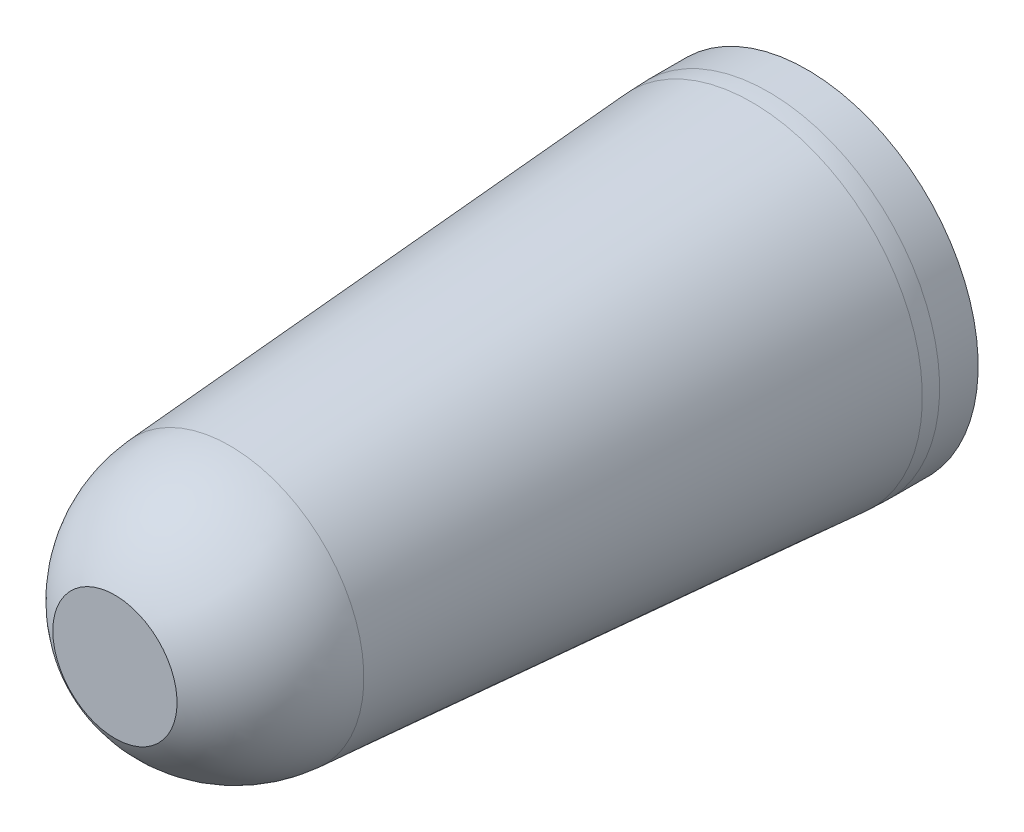
ISO-10303-21;
HEADER;
FILE_DESCRIPTION(('STEP AP214'),'2;1');
FILE_NAME('part.step','',(''),(''),'','','');
FILE_SCHEMA(('AUTOMOTIVE_DESIGN { 1 0 10303 214 1 1 1 1 }'));
ENDSEC;
DATA;
#1=APPLICATION_CONTEXT('core data for automotive mechanical design processes');
#2=APPLICATION_PROTOCOL_DEFINITION('international standard','automotive_design',2000,#1);
#3=PRODUCT_CONTEXT('',#1,'mechanical');
#4=PRODUCT('Part','Part','',(#3));
#5=PRODUCT_RELATED_PRODUCT_CATEGORY('part','',(#4));
#6=PRODUCT_DEFINITION_FORMATION('','',#4);
#7=PRODUCT_DEFINITION_CONTEXT('part definition',#1,'design');
#8=PRODUCT_DEFINITION('design','',#6,#7);
#9=PRODUCT_DEFINITION_SHAPE('','',#8);
#10=(LENGTH_UNIT() NAMED_UNIT(*) SI_UNIT(.MILLI.,.METRE.));
#11=(NAMED_UNIT(*) PLANE_ANGLE_UNIT() SI_UNIT($,.RADIAN.));
#12=(NAMED_UNIT(*) SI_UNIT($,.STERADIAN.) SOLID_ANGLE_UNIT());
#13=UNCERTAINTY_MEASURE_WITH_UNIT(LENGTH_MEASURE(1.E-05),#10,'distance_accuracy_value','');
#14=(GEOMETRIC_REPRESENTATION_CONTEXT(3) GLOBAL_UNCERTAINTY_ASSIGNED_CONTEXT((#13)) GLOBAL_UNIT_ASSIGNED_CONTEXT((#10,
#11,#12)) REPRESENTATION_CONTEXT('',''));
#15=CARTESIAN_POINT('',(0.,0.,0.));
#16=DIRECTION('',(0.,0.,1.));
#17=DIRECTION('',(1.,0.,0.));
#18=AXIS2_PLACEMENT_3D('',#15,#16,#17);
#19=CARTESIAN_POINT('',(0.,49.747863484737,0.));
#20=DIRECTION('',(0.,0.,-1.));
#21=DIRECTION('',(-1.,0.,0.));
#22=AXIS2_PLACEMENT_3D('',#19,#20,#21);
#23=PLANE('',#22);
#24=CARTESIAN_POINT('',(0.,-7.40213651526299,0.));
#25=DIRECTION('',(0.,0.,-1.));
#26=DIRECTION('',(-1.,0.,0.));
#27=AXIS2_PLACEMENT_3D('',#24,#25,#26);
#28=CIRCLE('',#27,57.15);
#29=CARTESIAN_POINT('',(-57.15,-7.40213651526299,0.));
#30=VERTEX_POINT('',#29);
#31=EDGE_CURVE('E10',#30,#30,#28,.T.);
#32=ORIENTED_EDGE('',*,*,#31,.T.);
#33=EDGE_LOOP('',(#32));
#34=FACE_BOUND('',#33,.T.);
#35=ADVANCED_FACE('F31',(#34),#23,.T.);
#36=CARTESIAN_POINT('',(0.,-7.40213651526299,0.));
#37=DIRECTION('',(0.,0.,-1.));
#38=DIRECTION('',(-1.,0.,0.));
#39=AXIS2_PLACEMENT_3D('',#36,#37,#38);
#40=CYLINDRICAL_SURFACE('',#39,57.15);
#41=CARTESIAN_POINT('',(0.,-7.40213651526299,12.8781013386161));
#42=DIRECTION('',(0.,0.,-1.));
#43=DIRECTION('',(-1.,0.,0.));
#44=AXIS2_PLACEMENT_3D('',#41,#42,#43);
#45=CIRCLE('',#44,57.15);
#46=CARTESIAN_POINT('',(-57.15,-7.40213651526299,12.8781013386161));
#47=VERTEX_POINT('',#46);
#48=EDGE_CURVE('E37',#47,#47,#45,.T.);
#49=ORIENTED_EDGE('',*,*,#48,.T.);
#50=EDGE_LOOP('',(#49));
#51=FACE_BOUND('',#50,.T.);
#52=ORIENTED_EDGE('',*,*,#31,.F.);
#53=EDGE_LOOP('',(#52));
#54=FACE_BOUND('',#53,.T.);
#55=ADVANCED_FACE('F66',(#51,#54),#40,.T.);
#56=CARTESIAN_POINT('',(0.,-7.40213651526299,12.8781013386161));
#57=DIRECTION('',(0.,0.,-1.));
#58=DIRECTION('',(-1.,0.,0.));
#59=AXIS2_PLACEMENT_3D('',#56,#57,#58);
#60=DEGENERATE_TOROIDAL_SURFACE('',#59,22.759953943987,79.909953943987,.F.);
#61=CARTESIAN_POINT('',(0.,-7.40213651526299,18.4523379428041));
#62=DIRECTION('',(0.,0.,-1.));
#63=DIRECTION('',(-1.,0.,0.));
#64=AXIS2_PLACEMENT_3D('',#61,#62,#63);
#65=CIRCLE('',#64,56.9553433684527);
#66=CARTESIAN_POINT('',(-56.9553433684527,-7.40213651526299,18.4523379428041));
#67=VERTEX_POINT('',#66);
#68=EDGE_CURVE('E41',#67,#67,#65,.T.);
#69=ORIENTED_EDGE('',*,*,#68,.T.);
#70=EDGE_LOOP('',(#69));
#71=FACE_BOUND('',#70,.T.);
#72=ORIENTED_EDGE('',*,*,#48,.F.);
#73=EDGE_LOOP('',(#72));
#74=FACE_BOUND('',#73,.T.);
#75=ADVANCED_FACE('F70',(#71,#74),#60,.F.);
#76=CARTESIAN_POINT('',(0.,-7.40213651526299,18.4523379428041));
#77=DIRECTION('',(0.,0.,-1.));
#78=DIRECTION('',(-1.,0.,0.));
#79=AXIS2_PLACEMENT_3D('',#76,#77,#78);
#80=CONICAL_SURFACE('',#79,56.9553433684527,0.0698131700797741);
#81=CARTESIAN_POINT('',(0.,-7.40213651526299,192.854569692954));
#82=DIRECTION('',(0.,0.,-1.));
#83=DIRECTION('',(-1.,0.,0.));
#84=AXIS2_PLACEMENT_3D('',#81,#82,#83);
#85=CIRCLE('',#84,44.7599513063313);
#86=CARTESIAN_POINT('',(-44.7599513063313,-7.40213651526299,192.854569692954));
#87=VERTEX_POINT('',#86);
#88=EDGE_CURVE('E45',#87,#87,#85,.T.);
#89=ORIENTED_EDGE('',*,*,#88,.T.);
#90=EDGE_LOOP('',(#89));
#91=FACE_BOUND('',#90,.T.);
#92=ORIENTED_EDGE('',*,*,#68,.F.);
#93=EDGE_LOOP('',(#92));
#94=FACE_BOUND('',#93,.T.);
#95=ADVANCED_FACE('F63',(#91,#94),#80,.T.);
#96=CARTESIAN_POINT('',(0.,-7.40213651526299,189.488851096283));
#97=DIRECTION('',(0.,0.,-1.));
#98=DIRECTION('',(-1.,0.,0.));
#99=AXIS2_PLACEMENT_3D('',#96,#97,#98);
#100=DEGENERATE_TOROIDAL_SURFACE('',#99,3.37206705866781,48.2495518482875,.F.);
#101=CARTESIAN_POINT('',(0.,-7.40213651526299,231.274188718115));
#102=DIRECTION('',(0.,0.,-1.));
#103=DIRECTION('',(-1.,0.,0.));
#104=AXIS2_PLACEMENT_3D('',#101,#102,#103);
#105=CIRCLE('',#104,20.7527088654753);
#106=CARTESIAN_POINT('',(-20.7527088654753,-7.40213651526299,231.274188718115));
#107=VERTEX_POINT('',#106);
#108=EDGE_CURVE('E50',#107,#107,#105,.T.);
#109=ORIENTED_EDGE('',*,*,#108,.T.);
#110=EDGE_LOOP('',(#109));
#111=FACE_BOUND('',#110,.T.);
#112=ORIENTED_EDGE('',*,*,#88,.F.);
#113=EDGE_LOOP('',(#112));
#114=FACE_BOUND('',#113,.T.);
#115=ADVANCED_FACE('F54',(#111,#114),#100,.F.);
#116=CARTESIAN_POINT('',(0.,-7.40213651526299,231.274188718115));
#117=DIRECTION('',(0.,0.,1.));
#118=DIRECTION('',(1.,0.,0.));
#119=AXIS2_PLACEMENT_3D('',#116,#117,#118);
#120=PLANE('',#119);
#121=ORIENTED_EDGE('',*,*,#108,.F.);
#122=EDGE_LOOP('',(#121));
#123=FACE_BOUND('',#122,.T.);
#124=ADVANCED_FACE('F57',(#123),#120,.T.);
#125=CLOSED_SHELL('',(#35,#55,#75,#95,#115,#124));
#126=MANIFOLD_SOLID_BREP('B2',#125);
#127=ADVANCED_BREP_SHAPE_REPRESENTATION('',(#18,#126),#14);
#128=SHAPE_DEFINITION_REPRESENTATION(#9,#127);
ENDSEC;
END-ISO-10303-21;
